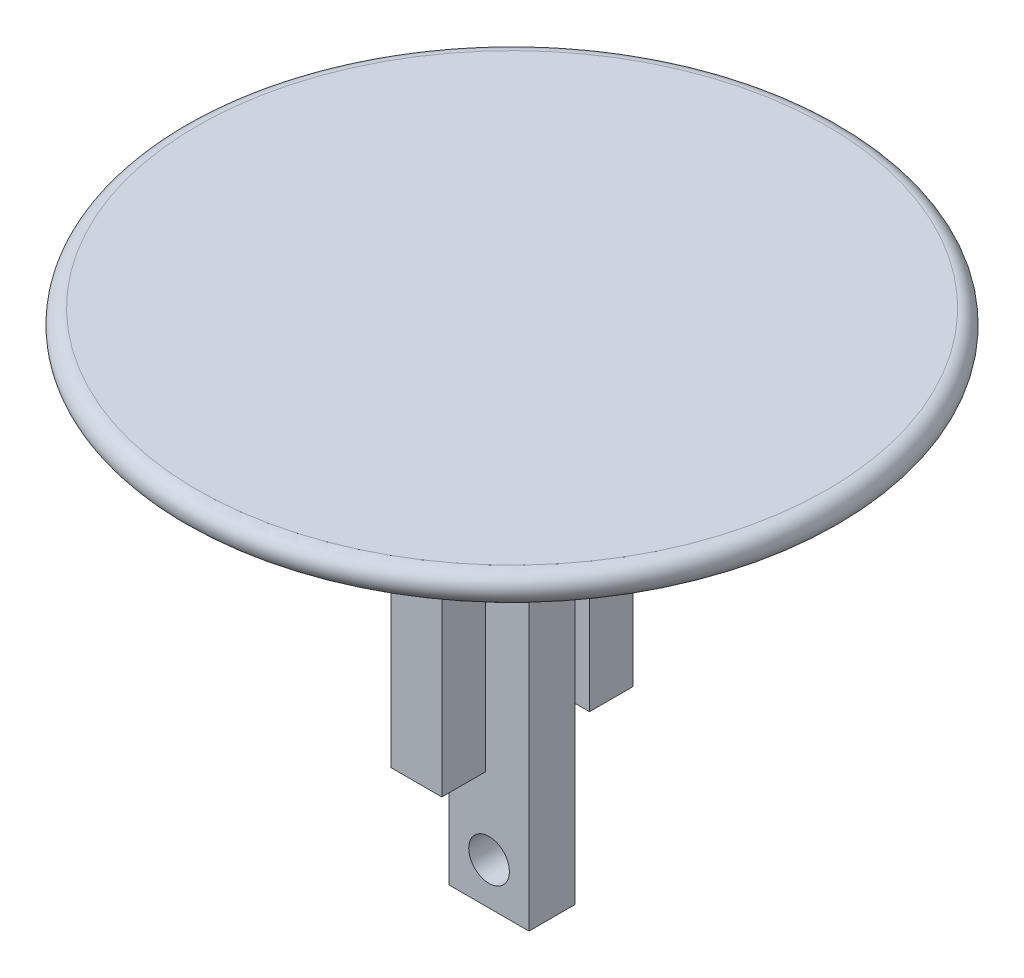
ISO-10303-21;
HEADER;
FILE_DESCRIPTION(('STEP AP214'),'2;1');
FILE_NAME('part.step','',(''),(''),'','','');
FILE_SCHEMA(('AUTOMOTIVE_DESIGN { 1 0 10303 214 1 1 1 1 }'));
ENDSEC;
DATA;
#1=APPLICATION_CONTEXT('core data for automotive mechanical design processes');
#2=APPLICATION_PROTOCOL_DEFINITION('international standard','automotive_design',2000,#1);
#3=PRODUCT_CONTEXT('',#1,'mechanical');
#4=PRODUCT('Part','Part','',(#3));
#5=PRODUCT_RELATED_PRODUCT_CATEGORY('part','',(#4));
#6=PRODUCT_DEFINITION_FORMATION('','',#4);
#7=PRODUCT_DEFINITION_CONTEXT('part definition',#1,'design');
#8=PRODUCT_DEFINITION('design','',#6,#7);
#9=PRODUCT_DEFINITION_SHAPE('','',#8);
#10=(LENGTH_UNIT() NAMED_UNIT(*) SI_UNIT(.MILLI.,.METRE.));
#11=(NAMED_UNIT(*) PLANE_ANGLE_UNIT() SI_UNIT($,.RADIAN.));
#12=(NAMED_UNIT(*) SI_UNIT($,.STERADIAN.) SOLID_ANGLE_UNIT());
#13=UNCERTAINTY_MEASURE_WITH_UNIT(LENGTH_MEASURE(1.E-05),#10,'distance_accuracy_value','');
#14=(GEOMETRIC_REPRESENTATION_CONTEXT(3) GLOBAL_UNCERTAINTY_ASSIGNED_CONTEXT((#13)) GLOBAL_UNIT_ASSIGNED_CONTEXT((#10,
#11,#12)) REPRESENTATION_CONTEXT('',''));
#15=CARTESIAN_POINT('',(0.,0.,0.));
#16=DIRECTION('',(0.,0.,1.));
#17=DIRECTION('',(1.,0.,0.));
#18=AXIS2_PLACEMENT_3D('',#15,#16,#17);
#19=CARTESIAN_POINT('',(10.,-10.,0.));
#20=DIRECTION('',(0.,1.,0.));
#21=DIRECTION('',(-1.,0.,0.));
#22=AXIS2_PLACEMENT_3D('',#19,#20,#21);
#23=PLANE('',#22);
#24=DIRECTION('',(0.,0.,-1.));
#25=VECTOR('',#24,1.);
#26=CARTESIAN_POINT('',(-1.75136168975565,-10.,-6.58393930540116));
#27=LINE('',#26,#25);
#28=CARTESIAN_POINT('',(-1.75136168975565,-10.,-3.58393930540116));
#29=VERTEX_POINT('',#28);
#30=CARTESIAN_POINT('',(-1.75136168975565,-10.,-6.58393930540116));
#31=VERTEX_POINT('',#30);
#32=EDGE_CURVE('E147',#29,#31,#27,.T.);
#33=ORIENTED_EDGE('',*,*,#32,.F.);
#34=DIRECTION('',(-1.,0.,0.));
#35=VECTOR('',#34,1.);
#36=CARTESIAN_POINT('',(-1.75136168975565,-10.,-3.58393930540116));
#37=LINE('',#36,#35);
#38=CARTESIAN_POINT('',(1.74863831024435,-10.,-3.58393930540116));
#39=VERTEX_POINT('',#38);
#40=EDGE_CURVE('E160',#39,#29,#37,.T.);
#41=ORIENTED_EDGE('',*,*,#40,.F.);
#42=DIRECTION('',(0.,0.,1.));
#43=VECTOR('',#42,1.);
#44=CARTESIAN_POINT('',(1.74863831024435,-10.,-6.58393930540116));
#45=LINE('',#44,#43);
#46=CARTESIAN_POINT('',(1.74863831024435,-10.,-6.58393930540116));
#47=VERTEX_POINT('',#46);
#48=EDGE_CURVE('E169',#47,#39,#45,.T.);
#49=ORIENTED_EDGE('',*,*,#48,.F.);
#50=DIRECTION('',(1.,0.,0.));
#51=VECTOR('',#50,1.);
#52=CARTESIAN_POINT('',(-1.75136168975565,-10.,-6.58393930540116));
#53=LINE('',#52,#51);
#54=EDGE_CURVE('E150',#31,#47,#53,.T.);
#55=ORIENTED_EDGE('',*,*,#54,.F.);
#56=EDGE_LOOP('',(#33,#41,#49,#55));
#57=FACE_BOUND('',#56,.T.);
#58=CARTESIAN_POINT('',(0.,-10.,0.));
#59=DIRECTION('',(0.,1.,0.));
#60=DIRECTION('',(-1.,0.,0.));
#61=AXIS2_PLACEMENT_3D('',#58,#59,#60);
#62=CIRCLE('',#61,10.);
#63=CARTESIAN_POINT('',(-10.,-10.,0.));
#64=VERTEX_POINT('',#63);
#65=EDGE_CURVE('E222',#64,#64,#62,.T.);
#66=ORIENTED_EDGE('',*,*,#65,.F.);
#67=EDGE_LOOP('',(#66));
#68=FACE_BOUND('',#67,.T.);
#69=DIRECTION('',(0.,0.,-1.));
#70=VECTOR('',#69,1.);
#71=CARTESIAN_POINT('',(-2.75136168975565,-10.,-1.58393930540116));
#72=LINE('',#71,#70);
#73=CARTESIAN_POINT('',(-2.75136168975565,-10.,1.58606069459884));
#74=VERTEX_POINT('',#73);
#75=CARTESIAN_POINT('',(-2.75136168975565,-10.,-1.58393930540116));
#76=VERTEX_POINT('',#75);
#77=EDGE_CURVE('E200',#74,#76,#72,.T.);
#78=ORIENTED_EDGE('',*,*,#77,.F.);
#79=DIRECTION('',(-1.,0.,0.));
#80=VECTOR('',#79,1.);
#81=CARTESIAN_POINT('',(-2.75136168975565,-10.,1.58606069459884));
#82=LINE('',#81,#80);
#83=CARTESIAN_POINT('',(2.74863831024435,-10.,1.58606069459884));
#84=VERTEX_POINT('',#83);
#85=EDGE_CURVE('E193',#84,#74,#82,.T.);
#86=ORIENTED_EDGE('',*,*,#85,.F.);
#87=DIRECTION('',(0.,0.,1.));
#88=VECTOR('',#87,1.);
#89=CARTESIAN_POINT('',(2.74863831024435,-10.,-1.58393930540116));
#90=LINE('',#89,#88);
#91=CARTESIAN_POINT('',(2.74863831024435,-10.,-1.58393930540116));
#92=VERTEX_POINT('',#91);
#93=EDGE_CURVE('E206',#92,#84,#90,.T.);
#94=ORIENTED_EDGE('',*,*,#93,.F.);
#95=DIRECTION('',(1.,0.,0.));
#96=VECTOR('',#95,1.);
#97=CARTESIAN_POINT('',(-2.75136168975565,-10.,-1.58393930540116));
#98=LINE('',#97,#96);
#99=EDGE_CURVE('E203',#76,#92,#98,.T.);
#100=ORIENTED_EDGE('',*,*,#99,.F.);
#101=EDGE_LOOP('',(#78,#86,#94,#100));
#102=FACE_BOUND('',#101,.T.);
#103=DIRECTION('',(0.,0.,-1.));
#104=VECTOR('',#103,1.);
#105=CARTESIAN_POINT('',(-1.75136168975565,-10.,3.58606069459884));
#106=LINE('',#105,#104);
#107=CARTESIAN_POINT('',(-1.75136168975565,-10.,6.58606069459884));
#108=VERTEX_POINT('',#107);
#109=CARTESIAN_POINT('',(-1.75136168975565,-10.,3.58606069459884));
#110=VERTEX_POINT('',#109);
#111=EDGE_CURVE('E146',#108,#110,#106,.T.);
#112=ORIENTED_EDGE('',*,*,#111,.F.);
#113=DIRECTION('',(-1.,0.,0.));
#114=VECTOR('',#113,1.);
#115=CARTESIAN_POINT('',(-1.75136168975565,-10.,6.58606069459884));
#116=LINE('',#115,#114);
#117=CARTESIAN_POINT('',(1.74863831024435,-10.,6.58606069459884));
#118=VERTEX_POINT('',#117);
#119=EDGE_CURVE('E143',#118,#108,#116,.T.);
#120=ORIENTED_EDGE('',*,*,#119,.F.);
#121=DIRECTION('',(0.,0.,1.));
#122=VECTOR('',#121,1.);
#123=CARTESIAN_POINT('',(1.74863831024435,-10.,3.58606069459884));
#124=LINE('',#123,#122);
#125=CARTESIAN_POINT('',(1.74863831024435,-10.,3.58606069459884));
#126=VERTEX_POINT('',#125);
#127=EDGE_CURVE('E57',#126,#118,#124,.T.);
#128=ORIENTED_EDGE('',*,*,#127,.F.);
#129=DIRECTION('',(1.,0.,0.));
#130=VECTOR('',#129,1.);
#131=CARTESIAN_POINT('',(-1.75136168975565,-10.,3.58606069459884));
#132=LINE('',#131,#130);
#133=EDGE_CURVE('E52',#110,#126,#132,.T.);
#134=ORIENTED_EDGE('',*,*,#133,.F.);
#135=EDGE_LOOP('',(#112,#120,#128,#134));
#136=FACE_BOUND('',#135,.T.);
#137=ADVANCED_FACE('F37',(#57,#68,#102,#136),#23,.F.);
#138=CARTESIAN_POINT('',(0.,0.,0.));
#139=DIRECTION('',(0.,-1.,0.));
#140=DIRECTION('',(1.,0.,0.));
#141=AXIS2_PLACEMENT_3D('',#138,#139,#140);
#142=PLANE('',#141);
#143=CARTESIAN_POINT('',(0.,0.,0.));
#144=DIRECTION('',(0.,-1.,0.));
#145=DIRECTION('',(1.,0.,0.));
#146=AXIS2_PLACEMENT_3D('',#143,#144,#145);
#147=CIRCLE('',#146,21.697224362268);
#148=CARTESIAN_POINT('',(21.697224362268,0.,0.));
#149=VERTEX_POINT('',#148);
#150=EDGE_CURVE('E45',#149,#149,#147,.F.);
#151=ORIENTED_EDGE('',*,*,#150,.T.);
#152=EDGE_LOOP('',(#151));
#153=FACE_BOUND('',#152,.T.);
#154=ADVANCED_FACE('F229',(#153),#142,.F.);
#155=CARTESIAN_POINT('',(0.,-10.,0.));
#156=DIRECTION('',(0.,1.,0.));
#157=DIRECTION('',(-1.,0.,0.));
#158=AXIS2_PLACEMENT_3D('',#155,#156,#157);
#159=CONICAL_SURFACE('',#158,10.,0.982793723247329);
#160=CARTESIAN_POINT('',(0.,-1.83205029433785,0.));
#161=DIRECTION('',(0.,-1.,0.));
#162=DIRECTION('',(1.,0.,0.));
#163=AXIS2_PLACEMENT_3D('',#160,#161,#162);
#164=CIRCLE('',#163,22.2519245584932);
#165=CARTESIAN_POINT('',(22.2519245584932,-1.83205029433784,0.));
#166=VERTEX_POINT('',#165);
#167=EDGE_CURVE('E11',#166,#166,#164,.T.);
#168=ORIENTED_EDGE('',*,*,#167,.T.);
#169=EDGE_LOOP('',(#168));
#170=FACE_BOUND('',#169,.T.);
#171=ORIENTED_EDGE('',*,*,#65,.T.);
#172=EDGE_LOOP('',(#171));
#173=FACE_BOUND('',#172,.T.);
#174=ADVANCED_FACE('F245',(#170,#173),#159,.T.);
#175=CARTESIAN_POINT('',(-2.75136168975564,-35.,-1.58393930540116));
#176=DIRECTION('',(1.,0.,0.));
#177=DIRECTION('',(0.,1.,0.));
#178=AXIS2_PLACEMENT_3D('',#175,#176,#177);
#179=PLANE('',#178);
#180=ORIENTED_EDGE('',*,*,#77,.T.);
#181=DIRECTION('',(0.,1.,0.));
#182=VECTOR('',#181,1.);
#183=CARTESIAN_POINT('',(-2.75136168975564,-35.,-1.58393930540116));
#184=LINE('',#183,#182);
#185=CARTESIAN_POINT('',(-2.75136168975564,-35.,-1.58393930540116));
#186=VERTEX_POINT('',#185);
#187=EDGE_CURVE('E219',#186,#76,#184,.T.);
#188=ORIENTED_EDGE('',*,*,#187,.F.);
#189=DIRECTION('',(0.,0.,-1.));
#190=VECTOR('',#189,1.);
#191=CARTESIAN_POINT('',(-2.75136168975564,-35.,-1.58393930540116));
#192=LINE('',#191,#190);
#193=CARTESIAN_POINT('',(-2.75136168975564,-35.,1.58606069459884));
#194=VERTEX_POINT('',#193);
#195=EDGE_CURVE('E189',#194,#186,#192,.T.);
#196=ORIENTED_EDGE('',*,*,#195,.F.);
#197=DIRECTION('',(0.,1.,0.));
#198=VECTOR('',#197,1.);
#199=CARTESIAN_POINT('',(-2.75136168975564,-35.,1.58606069459884));
#200=LINE('',#199,#198);
#201=EDGE_CURVE('E199',#194,#74,#200,.T.);
#202=ORIENTED_EDGE('',*,*,#201,.T.);
#203=EDGE_LOOP('',(#180,#188,#196,#202));
#204=FACE_BOUND('',#203,.T.);
#205=ADVANCED_FACE('F249',(#204),#179,.F.);
#206=CARTESIAN_POINT('',(-2.75136168975564,-35.,-1.58393930540116));
#207=DIRECTION('',(0.,0.,1.));
#208=DIRECTION('',(1.,0.,0.));
#209=AXIS2_PLACEMENT_3D('',#206,#207,#208);
#210=PLANE('',#209);
#211=CARTESIAN_POINT('',(0.,-32.1284486216292,-1.58393930540116));
#212=DIRECTION('',(0.,0.,-1.));
#213=DIRECTION('',(-1.,0.,0.));
#214=AXIS2_PLACEMENT_3D('',#211,#212,#213);
#215=CIRCLE('',#214,1.4);
#216=CARTESIAN_POINT('',(-1.4,-32.1284486216292,-1.58393930540116));
#217=VERTEX_POINT('',#216);
#218=EDGE_CURVE('E185',#217,#217,#215,.T.);
#219=ORIENTED_EDGE('',*,*,#218,.F.);
#220=EDGE_LOOP('',(#219));
#221=FACE_BOUND('',#220,.T.);
#222=ORIENTED_EDGE('',*,*,#99,.T.);
#223=DIRECTION('',(0.,1.,0.));
#224=VECTOR('',#223,1.);
#225=CARTESIAN_POINT('',(2.74863831024436,-35.,-1.58393930540116));
#226=LINE('',#225,#224);
#227=CARTESIAN_POINT('',(2.74863831024436,-35.,-1.58393930540116));
#228=VERTEX_POINT('',#227);
#229=EDGE_CURVE('E216',#228,#92,#226,.T.);
#230=ORIENTED_EDGE('',*,*,#229,.F.);
#231=DIRECTION('',(1.,0.,0.));
#232=VECTOR('',#231,1.);
#233=CARTESIAN_POINT('',(-2.75136168975564,-35.,-1.58393930540116));
#234=LINE('',#233,#232);
#235=EDGE_CURVE('E192',#186,#228,#234,.T.);
#236=ORIENTED_EDGE('',*,*,#235,.F.);
#237=ORIENTED_EDGE('',*,*,#187,.T.);
#238=EDGE_LOOP('',(#222,#230,#236,#237));
#239=FACE_BOUND('',#238,.T.);
#240=ADVANCED_FACE('F256',(#221,#239),#210,.F.);
#241=CARTESIAN_POINT('',(2.74863831024436,-35.,-1.58393930540116));
#242=DIRECTION('',(-1.,0.,0.));
#243=DIRECTION('',(0.,-1.,0.));
#244=AXIS2_PLACEMENT_3D('',#241,#242,#243);
#245=PLANE('',#244);
#246=ORIENTED_EDGE('',*,*,#93,.T.);
#247=DIRECTION('',(0.,1.,0.));
#248=VECTOR('',#247,1.);
#249=CARTESIAN_POINT('',(2.74863831024436,-35.,1.58606069459884));
#250=LINE('',#249,#248);
#251=CARTESIAN_POINT('',(2.74863831024436,-35.,1.58606069459884));
#252=VERTEX_POINT('',#251);
#253=EDGE_CURVE('E213',#252,#84,#250,.T.);
#254=ORIENTED_EDGE('',*,*,#253,.F.);
#255=DIRECTION('',(0.,0.,1.));
#256=VECTOR('',#255,1.);
#257=CARTESIAN_POINT('',(2.74863831024436,-35.,-1.58393930540116));
#258=LINE('',#257,#256);
#259=EDGE_CURVE('E195',#228,#252,#258,.T.);
#260=ORIENTED_EDGE('',*,*,#259,.F.);
#261=ORIENTED_EDGE('',*,*,#229,.T.);
#262=EDGE_LOOP('',(#246,#254,#260,#261));
#263=FACE_BOUND('',#262,.T.);
#264=ADVANCED_FACE('F317',(#263),#245,.F.);
#265=CARTESIAN_POINT('',(-2.75136168975564,-35.,1.58606069459884));
#266=DIRECTION('',(0.,0.,-1.));
#267=DIRECTION('',(-1.,0.,0.));
#268=AXIS2_PLACEMENT_3D('',#265,#266,#267);
#269=PLANE('',#268);
#270=CARTESIAN_POINT('',(0.,-32.1284486216292,1.58606069459884));
#271=DIRECTION('',(0.,0.,-1.));
#272=DIRECTION('',(-1.,0.,0.));
#273=AXIS2_PLACEMENT_3D('',#270,#271,#272);
#274=CIRCLE('',#273,1.4);
#275=CARTESIAN_POINT('',(-1.4,-32.1284486216292,1.58606069459884));
#276=VERTEX_POINT('',#275);
#277=EDGE_CURVE('E188',#276,#276,#274,.T.);
#278=ORIENTED_EDGE('',*,*,#277,.T.);
#279=EDGE_LOOP('',(#278));
#280=FACE_BOUND('',#279,.T.);
#281=ORIENTED_EDGE('',*,*,#85,.T.);
#282=ORIENTED_EDGE('',*,*,#201,.F.);
#283=DIRECTION('',(-1.,0.,0.));
#284=VECTOR('',#283,1.);
#285=CARTESIAN_POINT('',(-2.75136168975564,-35.,1.58606069459884));
#286=LINE('',#285,#284);
#287=EDGE_CURVE('E197',#252,#194,#286,.T.);
#288=ORIENTED_EDGE('',*,*,#287,.F.);
#289=ORIENTED_EDGE('',*,*,#253,.T.);
#290=EDGE_LOOP('',(#281,#282,#288,#289));
#291=FACE_BOUND('',#290,.T.);
#292=ADVANCED_FACE('F313',(#280,#291),#269,.F.);
#293=CARTESIAN_POINT('',(0.,-35.,0.));
#294=DIRECTION('',(0.,1.,0.));
#295=DIRECTION('',(0.,0.,1.));
#296=AXIS2_PLACEMENT_3D('',#293,#294,#295);
#297=PLANE('',#296);
#298=ORIENTED_EDGE('',*,*,#195,.T.);
#299=ORIENTED_EDGE('',*,*,#235,.T.);
#300=ORIENTED_EDGE('',*,*,#259,.T.);
#301=ORIENTED_EDGE('',*,*,#287,.T.);
#302=EDGE_LOOP('',(#298,#299,#300,#301));
#303=FACE_BOUND('',#302,.T.);
#304=ADVANCED_FACE('F309',(#303),#297,.F.);
#305=CARTESIAN_POINT('',(0.,-32.1284486216292,25.));
#306=DIRECTION('',(0.,0.,-1.));
#307=DIRECTION('',(-1.,0.,0.));
#308=AXIS2_PLACEMENT_3D('',#305,#306,#307);
#309=CYLINDRICAL_SURFACE('',#308,1.4);
#310=ORIENTED_EDGE('',*,*,#218,.T.);
#311=EDGE_LOOP('',(#310));
#312=FACE_BOUND('',#311,.T.);
#313=ORIENTED_EDGE('',*,*,#277,.F.);
#314=EDGE_LOOP('',(#313));
#315=FACE_BOUND('',#314,.T.);
#316=ADVANCED_FACE('F305',(#312,#315),#309,.F.);
#317=CARTESIAN_POINT('',(-1.75136168975564,-25.,-6.58393930540116));
#318=DIRECTION('',(1.,0.,0.));
#319=DIRECTION('',(0.,1.,0.));
#320=AXIS2_PLACEMENT_3D('',#317,#318,#319);
#321=PLANE('',#320);
#322=ORIENTED_EDGE('',*,*,#32,.T.);
#323=DIRECTION('',(0.,1.,0.));
#324=VECTOR('',#323,1.);
#325=CARTESIAN_POINT('',(-1.75136168975564,-25.,-6.58393930540116));
#326=LINE('',#325,#324);
#327=CARTESIAN_POINT('',(-1.75136168975564,-25.,-6.58393930540116));
#328=VERTEX_POINT('',#327);
#329=EDGE_CURVE('E182',#328,#31,#326,.T.);
#330=ORIENTED_EDGE('',*,*,#329,.F.);
#331=DIRECTION('',(0.,0.,-1.));
#332=VECTOR('',#331,1.);
#333=CARTESIAN_POINT('',(-1.75136168975564,-25.,-6.58393930540116));
#334=LINE('',#333,#332);
#335=CARTESIAN_POINT('',(-1.75136168975564,-25.,-3.58393930540116));
#336=VERTEX_POINT('',#335);
#337=EDGE_CURVE('E156',#336,#328,#334,.T.);
#338=ORIENTED_EDGE('',*,*,#337,.F.);
#339=DIRECTION('',(0.,1.,0.));
#340=VECTOR('',#339,1.);
#341=CARTESIAN_POINT('',(-1.75136168975564,-25.,-3.58393930540116));
#342=LINE('',#341,#340);
#343=EDGE_CURVE('E165',#336,#29,#342,.T.);
#344=ORIENTED_EDGE('',*,*,#343,.T.);
#345=EDGE_LOOP('',(#322,#330,#338,#344));
#346=FACE_BOUND('',#345,.T.);
#347=ADVANCED_FACE('F301',(#346),#321,.F.);
#348=CARTESIAN_POINT('',(-1.75136168975564,-25.,-6.58393930540116));
#349=DIRECTION('',(0.,0.,1.));
#350=DIRECTION('',(1.,0.,0.));
#351=AXIS2_PLACEMENT_3D('',#348,#349,#350);
#352=PLANE('',#351);
#353=ORIENTED_EDGE('',*,*,#54,.T.);
#354=DIRECTION('',(0.,1.,0.));
#355=VECTOR('',#354,1.);
#356=CARTESIAN_POINT('',(1.74863831024436,-25.,-6.58393930540116));
#357=LINE('',#356,#355);
#358=CARTESIAN_POINT('',(1.74863831024436,-25.,-6.58393930540116));
#359=VERTEX_POINT('',#358);
#360=EDGE_CURVE('E179',#359,#47,#357,.T.);
#361=ORIENTED_EDGE('',*,*,#360,.F.);
#362=DIRECTION('',(1.,0.,0.));
#363=VECTOR('',#362,1.);
#364=CARTESIAN_POINT('',(-1.75136168975564,-25.,-6.58393930540116));
#365=LINE('',#364,#363);
#366=EDGE_CURVE('E159',#328,#359,#365,.T.);
#367=ORIENTED_EDGE('',*,*,#366,.F.);
#368=ORIENTED_EDGE('',*,*,#329,.T.);
#369=EDGE_LOOP('',(#353,#361,#367,#368));
#370=FACE_BOUND('',#369,.T.);
#371=ADVANCED_FACE('F297',(#370),#352,.F.);
#372=CARTESIAN_POINT('',(1.74863831024436,-25.,-6.58393930540116));
#373=DIRECTION('',(-1.,0.,0.));
#374=DIRECTION('',(0.,-1.,0.));
#375=AXIS2_PLACEMENT_3D('',#372,#373,#374);
#376=PLANE('',#375);
#377=ORIENTED_EDGE('',*,*,#48,.T.);
#378=DIRECTION('',(0.,1.,0.));
#379=VECTOR('',#378,1.);
#380=CARTESIAN_POINT('',(1.74863831024436,-25.,-3.58393930540116));
#381=LINE('',#380,#379);
#382=CARTESIAN_POINT('',(1.74863831024436,-25.,-3.58393930540116));
#383=VERTEX_POINT('',#382);
#384=EDGE_CURVE('E176',#383,#39,#381,.T.);
#385=ORIENTED_EDGE('',*,*,#384,.F.);
#386=DIRECTION('',(0.,0.,1.));
#387=VECTOR('',#386,1.);
#388=CARTESIAN_POINT('',(1.74863831024436,-25.,-6.58393930540116));
#389=LINE('',#388,#387);
#390=EDGE_CURVE('E162',#359,#383,#389,.T.);
#391=ORIENTED_EDGE('',*,*,#390,.F.);
#392=ORIENTED_EDGE('',*,*,#360,.T.);
#393=EDGE_LOOP('',(#377,#385,#391,#392));
#394=FACE_BOUND('',#393,.T.);
#395=ADVANCED_FACE('F293',(#394),#376,.F.);
#396=CARTESIAN_POINT('',(-1.75136168975564,-25.,-3.58393930540116));
#397=DIRECTION('',(0.,0.,-1.));
#398=DIRECTION('',(-1.,0.,0.));
#399=AXIS2_PLACEMENT_3D('',#396,#397,#398);
#400=PLANE('',#399);
#401=ORIENTED_EDGE('',*,*,#40,.T.);
#402=ORIENTED_EDGE('',*,*,#343,.F.);
#403=DIRECTION('',(-1.,0.,0.));
#404=VECTOR('',#403,1.);
#405=CARTESIAN_POINT('',(-1.75136168975564,-25.,-3.58393930540116));
#406=LINE('',#405,#404);
#407=EDGE_CURVE('E164',#383,#336,#406,.T.);
#408=ORIENTED_EDGE('',*,*,#407,.F.);
#409=ORIENTED_EDGE('',*,*,#384,.T.);
#410=EDGE_LOOP('',(#401,#402,#408,#409));
#411=FACE_BOUND('',#410,.T.);
#412=ADVANCED_FACE('F289',(#411),#400,.F.);
#413=CARTESIAN_POINT('',(0.,-25.,0.));
#414=DIRECTION('',(0.,1.,0.));
#415=DIRECTION('',(0.,0.,1.));
#416=AXIS2_PLACEMENT_3D('',#413,#414,#415);
#417=PLANE('',#416);
#418=ORIENTED_EDGE('',*,*,#337,.T.);
#419=ORIENTED_EDGE('',*,*,#366,.T.);
#420=ORIENTED_EDGE('',*,*,#390,.T.);
#421=ORIENTED_EDGE('',*,*,#407,.T.);
#422=EDGE_LOOP('',(#418,#419,#420,#421));
#423=FACE_BOUND('',#422,.T.);
#424=ADVANCED_FACE('F286',(#423),#417,.F.);
#425=CARTESIAN_POINT('',(-1.75136168975564,-25.,3.58606069459884));
#426=DIRECTION('',(1.,0.,0.));
#427=DIRECTION('',(0.,1.,0.));
#428=AXIS2_PLACEMENT_3D('',#425,#426,#427);
#429=PLANE('',#428);
#430=ORIENTED_EDGE('',*,*,#111,.T.);
#431=DIRECTION('',(0.,1.,0.));
#432=VECTOR('',#431,1.);
#433=CARTESIAN_POINT('',(-1.75136168975564,-25.,3.58606069459884));
#434=LINE('',#433,#432);
#435=CARTESIAN_POINT('',(-1.75136168975564,-25.,3.58606069459884));
#436=VERTEX_POINT('',#435);
#437=EDGE_CURVE('E127',#436,#110,#434,.T.);
#438=ORIENTED_EDGE('',*,*,#437,.F.);
#439=DIRECTION('',(0.,0.,-1.));
#440=VECTOR('',#439,1.);
#441=CARTESIAN_POINT('',(-1.75136168975564,-25.,3.58606069459884));
#442=LINE('',#441,#440);
#443=CARTESIAN_POINT('',(-1.75136168975564,-25.,6.58606069459884));
#444=VERTEX_POINT('',#443);
#445=EDGE_CURVE('E134',#444,#436,#442,.T.);
#446=ORIENTED_EDGE('',*,*,#445,.F.);
#447=DIRECTION('',(0.,1.,0.));
#448=VECTOR('',#447,1.);
#449=CARTESIAN_POINT('',(-1.75136168975564,-25.,6.58606069459884));
#450=LINE('',#449,#448);
#451=EDGE_CURVE('E265',#444,#108,#450,.T.);
#452=ORIENTED_EDGE('',*,*,#451,.T.);
#453=EDGE_LOOP('',(#430,#438,#446,#452));
#454=FACE_BOUND('',#453,.T.);
#455=ADVANCED_FACE('F145',(#454),#429,.F.);
#456=CARTESIAN_POINT('',(-1.75136168975564,-25.,3.58606069459884));
#457=DIRECTION('',(0.,0.,1.));
#458=DIRECTION('',(1.,0.,0.));
#459=AXIS2_PLACEMENT_3D('',#456,#457,#458);
#460=PLANE('',#459);
#461=ORIENTED_EDGE('',*,*,#133,.T.);
#462=DIRECTION('',(0.,1.,0.));
#463=VECTOR('',#462,1.);
#464=CARTESIAN_POINT('',(1.74863831024436,-25.,3.58606069459884));
#465=LINE('',#464,#463);
#466=CARTESIAN_POINT('',(1.74863831024436,-25.,3.58606069459884));
#467=VERTEX_POINT('',#466);
#468=EDGE_CURVE('E130',#467,#126,#465,.T.);
#469=ORIENTED_EDGE('',*,*,#468,.F.);
#470=DIRECTION('',(1.,0.,0.));
#471=VECTOR('',#470,1.);
#472=CARTESIAN_POINT('',(-1.75136168975564,-25.,3.58606069459884));
#473=LINE('',#472,#471);
#474=EDGE_CURVE('E123',#436,#467,#473,.T.);
#475=ORIENTED_EDGE('',*,*,#474,.F.);
#476=ORIENTED_EDGE('',*,*,#437,.T.);
#477=EDGE_LOOP('',(#461,#469,#475,#476));
#478=FACE_BOUND('',#477,.T.);
#479=ADVANCED_FACE('F125',(#478),#460,.F.);
#480=CARTESIAN_POINT('',(1.74863831024436,-25.,3.58606069459884));
#481=DIRECTION('',(-1.,0.,0.));
#482=DIRECTION('',(0.,-1.,0.));
#483=AXIS2_PLACEMENT_3D('',#480,#481,#482);
#484=PLANE('',#483);
#485=ORIENTED_EDGE('',*,*,#127,.T.);
#486=DIRECTION('',(0.,1.,0.));
#487=VECTOR('',#486,1.);
#488=CARTESIAN_POINT('',(1.74863831024436,-25.,6.58606069459884));
#489=LINE('',#488,#487);
#490=CARTESIAN_POINT('',(1.74863831024436,-25.,6.58606069459884));
#491=VERTEX_POINT('',#490);
#492=EDGE_CURVE('E152',#491,#118,#489,.T.);
#493=ORIENTED_EDGE('',*,*,#492,.F.);
#494=DIRECTION('',(0.,0.,1.));
#495=VECTOR('',#494,1.);
#496=CARTESIAN_POINT('',(1.74863831024436,-25.,3.58606069459884));
#497=LINE('',#496,#495);
#498=EDGE_CURVE('E133',#467,#491,#497,.T.);
#499=ORIENTED_EDGE('',*,*,#498,.F.);
#500=ORIENTED_EDGE('',*,*,#468,.T.);
#501=EDGE_LOOP('',(#485,#493,#499,#500));
#502=FACE_BOUND('',#501,.T.);
#503=ADVANCED_FACE('F274',(#502),#484,.F.);
#504=CARTESIAN_POINT('',(-1.75136168975564,-25.,6.58606069459884));
#505=DIRECTION('',(0.,0.,-1.));
#506=DIRECTION('',(-1.,0.,0.));
#507=AXIS2_PLACEMENT_3D('',#504,#505,#506);
#508=PLANE('',#507);
#509=ORIENTED_EDGE('',*,*,#119,.T.);
#510=ORIENTED_EDGE('',*,*,#451,.F.);
#511=DIRECTION('',(-1.,0.,0.));
#512=VECTOR('',#511,1.);
#513=CARTESIAN_POINT('',(-1.75136168975564,-25.,6.58606069459884));
#514=LINE('',#513,#512);
#515=EDGE_CURVE('E139',#491,#444,#514,.T.);
#516=ORIENTED_EDGE('',*,*,#515,.F.);
#517=ORIENTED_EDGE('',*,*,#492,.T.);
#518=EDGE_LOOP('',(#509,#510,#516,#517));
#519=FACE_BOUND('',#518,.T.);
#520=ADVANCED_FACE('F236',(#519),#508,.F.);
#521=CARTESIAN_POINT('',(0.,-25.,0.));
#522=DIRECTION('',(0.,1.,0.));
#523=DIRECTION('',(0.,0.,1.));
#524=AXIS2_PLACEMENT_3D('',#521,#522,#523);
#525=PLANE('',#524);
#526=ORIENTED_EDGE('',*,*,#445,.T.);
#527=ORIENTED_EDGE('',*,*,#474,.T.);
#528=ORIENTED_EDGE('',*,*,#498,.T.);
#529=ORIENTED_EDGE('',*,*,#515,.T.);
#530=EDGE_LOOP('',(#526,#527,#528,#529));
#531=FACE_BOUND('',#530,.T.);
#532=ADVANCED_FACE('F137',(#531),#525,.F.);
#533=CARTESIAN_POINT('',(0.,-1.,0.));
#534=DIRECTION('',(0.,-1.,0.));
#535=DIRECTION('',(1.,0.,0.));
#536=AXIS2_PLACEMENT_3D('',#533,#534,#535);
#537=TOROIDAL_SURFACE('',#536,21.697224362268,1.);
#538=ORIENTED_EDGE('',*,*,#167,.F.);
#539=EDGE_LOOP('',(#538));
#540=FACE_BOUND('',#539,.T.);
#541=ORIENTED_EDGE('',*,*,#150,.F.);
#542=EDGE_LOOP('',(#541));
#543=FACE_BOUND('',#542,.T.);
#544=ADVANCED_FACE('F39',(#540,#543),#537,.T.);
#545=CLOSED_SHELL('',(#137,#154,#174,#205,#240,#264,#292,#304,#316,#347,#371,#395,#412,#424,
#455,#479,#503,#520,#532,#544));
#546=MANIFOLD_SOLID_BREP('B2',#545);
#547=ADVANCED_BREP_SHAPE_REPRESENTATION('',(#18,#546),#14);
#548=SHAPE_DEFINITION_REPRESENTATION(#9,#547);
ENDSEC;
END-ISO-10303-21;
